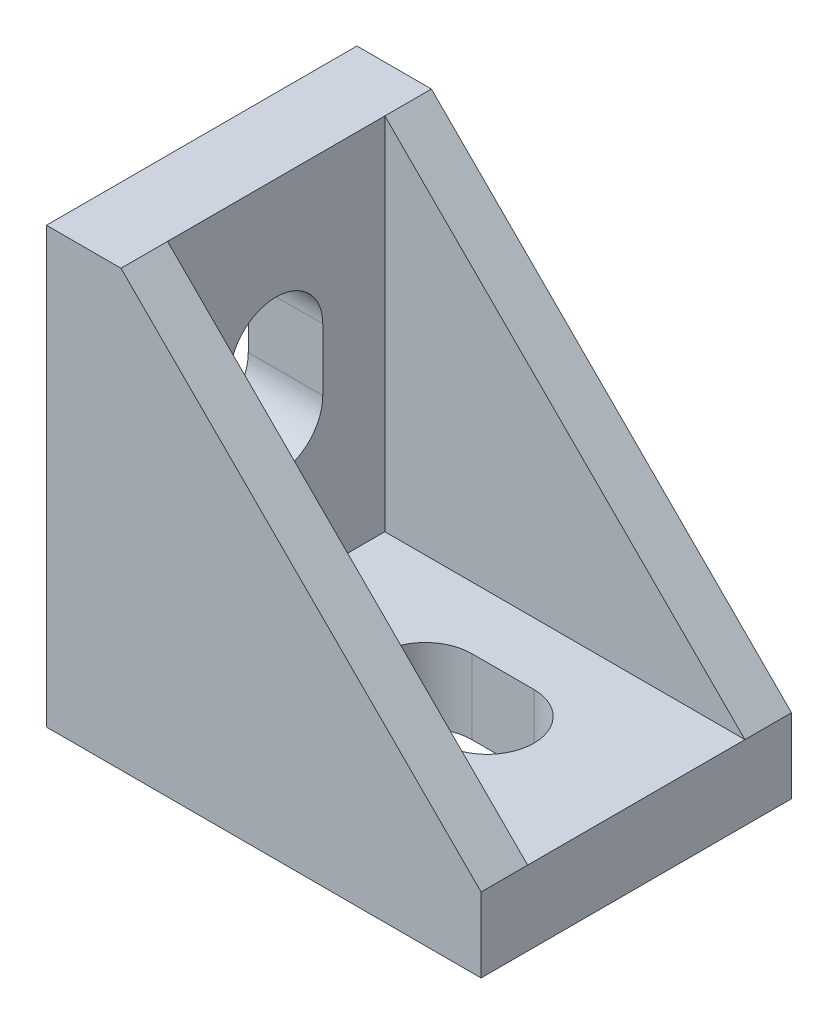
ISO-10303-21;
HEADER;
FILE_DESCRIPTION(('STEP AP214'),'2;1');
FILE_NAME('part.step','',(''),(''),'','','');
FILE_SCHEMA(('AUTOMOTIVE_DESIGN { 1 0 10303 214 1 1 1 1 }'));
ENDSEC;
DATA;
#1=APPLICATION_CONTEXT('core data for automotive mechanical design processes');
#2=APPLICATION_PROTOCOL_DEFINITION('international standard','automotive_design',2000,#1);
#3=PRODUCT_CONTEXT('',#1,'mechanical');
#4=PRODUCT('Part','Part','',(#3));
#5=PRODUCT_RELATED_PRODUCT_CATEGORY('part','',(#4));
#6=PRODUCT_DEFINITION_FORMATION('','',#4);
#7=PRODUCT_DEFINITION_CONTEXT('part definition',#1,'design');
#8=PRODUCT_DEFINITION('design','',#6,#7);
#9=PRODUCT_DEFINITION_SHAPE('','',#8);
#10=(LENGTH_UNIT() NAMED_UNIT(*) SI_UNIT(.MILLI.,.METRE.));
#11=(NAMED_UNIT(*) PLANE_ANGLE_UNIT() SI_UNIT($,.RADIAN.));
#12=(NAMED_UNIT(*) SI_UNIT($,.STERADIAN.) SOLID_ANGLE_UNIT());
#13=UNCERTAINTY_MEASURE_WITH_UNIT(LENGTH_MEASURE(1.E-05),#10,'distance_accuracy_value','');
#14=(GEOMETRIC_REPRESENTATION_CONTEXT(3) GLOBAL_UNCERTAINTY_ASSIGNED_CONTEXT((#13)) GLOBAL_UNIT_ASSIGNED_CONTEXT((#10,
#11,#12)) REPRESENTATION_CONTEXT('',''));
#15=CARTESIAN_POINT('',(0.,0.,0.));
#16=DIRECTION('',(0.,0.,1.));
#17=DIRECTION('',(1.,0.,0.));
#18=AXIS2_PLACEMENT_3D('',#15,#16,#17);
#19=CARTESIAN_POINT('',(0.,4.8,0.));
#20=DIRECTION('',(0.,-1.,0.));
#21=DIRECTION('',(0.,0.,-1.));
#22=AXIS2_PLACEMENT_3D('',#19,#20,#21);
#23=PLANE('',#22);
#24=DIRECTION('',(1.,0.,0.));
#25=VECTOR('',#24,1.);
#26=CARTESIAN_POINT('',(0.399999999999999,4.8,3.));
#27=LINE('',#26,#25);
#28=CARTESIAN_POINT('',(0.399999999999999,4.8,3.));
#29=VERTEX_POINT('',#28);
#30=CARTESIAN_POINT('',(4.4,4.8,3.));
#31=VERTEX_POINT('',#30);
#32=EDGE_CURVE('E220',#29,#31,#27,.T.);
#33=ORIENTED_EDGE('',*,*,#32,.F.);
#34=CARTESIAN_POINT('',(0.399999999999999,4.8,0.));
#35=DIRECTION('',(0.,1.,0.));
#36=DIRECTION('',(0.,0.,1.));
#37=AXIS2_PLACEMENT_3D('',#34,#35,#36);
#38=CIRCLE('',#37,3.);
#39=CARTESIAN_POINT('',(0.399999999999999,4.8,-3.));
#40=VERTEX_POINT('',#39);
#41=EDGE_CURVE('E55',#40,#29,#38,.T.);
#42=ORIENTED_EDGE('',*,*,#41,.F.);
#43=DIRECTION('',(-1.,0.,0.));
#44=VECTOR('',#43,1.);
#45=CARTESIAN_POINT('',(0.399999999999999,4.8,-3.));
#46=LINE('',#45,#44);
#47=CARTESIAN_POINT('',(4.4,4.8,-3.));
#48=VERTEX_POINT('',#47);
#49=EDGE_CURVE('E230',#48,#40,#46,.T.);
#50=ORIENTED_EDGE('',*,*,#49,.F.);
#51=CARTESIAN_POINT('',(4.4,4.8,0.));
#52=DIRECTION('',(0.,1.,0.));
#53=DIRECTION('',(0.,0.,1.));
#54=AXIS2_PLACEMENT_3D('',#51,#52,#53);
#55=CIRCLE('',#54,3.);
#56=EDGE_CURVE('E242',#31,#48,#55,.T.);
#57=ORIENTED_EDGE('',*,*,#56,.F.);
#58=EDGE_LOOP('',(#33,#42,#50,#57));
#59=FACE_BOUND('',#58,.T.);
#60=DIRECTION('',(0.,0.,-1.));
#61=VECTOR('',#60,1.);
#62=CARTESIAN_POINT('',(14.,4.8,10.));
#63=LINE('',#62,#61);
#64=CARTESIAN_POINT('',(14.,4.8,7.));
#65=VERTEX_POINT('',#64);
#66=CARTESIAN_POINT('',(14.,4.8,-7.));
#67=VERTEX_POINT('',#66);
#68=EDGE_CURVE('E169',#65,#67,#63,.T.);
#69=ORIENTED_EDGE('',*,*,#68,.T.);
#70=DIRECTION('',(-1.,0.,0.));
#71=VECTOR('',#70,1.);
#72=CARTESIAN_POINT('',(-9.2,4.8,-7.));
#73=LINE('',#72,#71);
#74=CARTESIAN_POINT('',(-9.2,4.8,-7.));
#75=VERTEX_POINT('',#74);
#76=EDGE_CURVE('E145',#67,#75,#73,.T.);
#77=ORIENTED_EDGE('',*,*,#76,.T.);
#78=DIRECTION('',(0.,0.,1.));
#79=VECTOR('',#78,1.);
#80=CARTESIAN_POINT('',(-9.2,4.8,0.));
#81=LINE('',#80,#79);
#82=CARTESIAN_POINT('',(-9.2,4.8,7.));
#83=VERTEX_POINT('',#82);
#84=EDGE_CURVE('E182',#75,#83,#81,.T.);
#85=ORIENTED_EDGE('',*,*,#84,.T.);
#86=DIRECTION('',(1.,0.,0.));
#87=VECTOR('',#86,1.);
#88=CARTESIAN_POINT('',(14.,4.8,7.));
#89=LINE('',#88,#87);
#90=EDGE_CURVE('E173',#83,#65,#89,.T.);
#91=ORIENTED_EDGE('',*,*,#90,.T.);
#92=EDGE_LOOP('',(#69,#77,#85,#91));
#93=FACE_BOUND('',#92,.T.);
#94=ADVANCED_FACE('F32',(#59,#93),#23,.F.);
#95=CARTESIAN_POINT('',(-9.2,0.,0.));
#96=DIRECTION('',(1.,0.,0.));
#97=DIRECTION('',(0.,0.,-1.));
#98=AXIS2_PLACEMENT_3D('',#95,#96,#97);
#99=PLANE('',#98);
#100=DIRECTION('',(0.,1.,0.));
#101=VECTOR('',#100,1.);
#102=CARTESIAN_POINT('',(-9.2,28.,-7.));
#103=LINE('',#102,#101);
#104=CARTESIAN_POINT('',(-9.2,28.,-7.));
#105=VERTEX_POINT('',#104);
#106=EDGE_CURVE('E150',#75,#105,#103,.T.);
#107=ORIENTED_EDGE('',*,*,#106,.T.);
#108=DIRECTION('',(0.,0.,-1.));
#109=VECTOR('',#108,1.);
#110=CARTESIAN_POINT('',(-9.2,28.,-10.));
#111=LINE('',#110,#109);
#112=CARTESIAN_POINT('',(-9.2,28.,7.));
#113=VERTEX_POINT('',#112);
#114=EDGE_CURVE('E290',#113,#105,#111,.T.);
#115=ORIENTED_EDGE('',*,*,#114,.F.);
#116=DIRECTION('',(0.,-1.,0.));
#117=VECTOR('',#116,1.);
#118=CARTESIAN_POINT('',(-9.2,4.8,7.));
#119=LINE('',#118,#117);
#120=EDGE_CURVE('E217',#113,#83,#119,.T.);
#121=ORIENTED_EDGE('',*,*,#120,.T.);
#122=ORIENTED_EDGE('',*,*,#84,.F.);
#123=EDGE_LOOP('',(#107,#115,#121,#122));
#124=FACE_BOUND('',#123,.T.);
#125=CARTESIAN_POINT('',(-9.2,18.4,0.));
#126=DIRECTION('',(1.,0.,0.));
#127=DIRECTION('',(0.,0.,-1.));
#128=AXIS2_PLACEMENT_3D('',#125,#126,#127);
#129=CIRCLE('',#128,3.);
#130=CARTESIAN_POINT('',(-9.2,18.4,-3.));
#131=VERTEX_POINT('',#130);
#132=CARTESIAN_POINT('',(-9.2,18.4,3.));
#133=VERTEX_POINT('',#132);
#134=EDGE_CURVE('E249',#131,#133,#129,.T.);
#135=ORIENTED_EDGE('',*,*,#134,.F.);
#136=DIRECTION('',(0.,1.,0.));
#137=VECTOR('',#136,1.);
#138=CARTESIAN_POINT('',(-9.2,18.4,-3.));
#139=LINE('',#138,#137);
#140=CARTESIAN_POINT('',(-9.2,14.4,-3.));
#141=VERTEX_POINT('',#140);
#142=EDGE_CURVE('E259',#141,#131,#139,.T.);
#143=ORIENTED_EDGE('',*,*,#142,.F.);
#144=CARTESIAN_POINT('',(-9.2,14.4,0.));
#145=DIRECTION('',(1.,0.,0.));
#146=DIRECTION('',(0.,0.,-1.));
#147=AXIS2_PLACEMENT_3D('',#144,#145,#146);
#148=CIRCLE('',#147,3.);
#149=CARTESIAN_POINT('',(-9.2,14.4,3.));
#150=VERTEX_POINT('',#149);
#151=EDGE_CURVE('E273',#150,#141,#148,.T.);
#152=ORIENTED_EDGE('',*,*,#151,.F.);
#153=DIRECTION('',(0.,-1.,0.));
#154=VECTOR('',#153,1.);
#155=CARTESIAN_POINT('',(-9.2,18.4,3.));
#156=LINE('',#155,#154);
#157=EDGE_CURVE('E270',#133,#150,#156,.T.);
#158=ORIENTED_EDGE('',*,*,#157,.F.);
#159=EDGE_LOOP('',(#135,#143,#152,#158));
#160=FACE_BOUND('',#159,.T.);
#161=ADVANCED_FACE('F302',(#124,#160),#99,.T.);
#162=CARTESIAN_POINT('',(14.,4.8,10.));
#163=DIRECTION('',(-1.,0.,0.));
#164=DIRECTION('',(0.,0.,1.));
#165=AXIS2_PLACEMENT_3D('',#162,#163,#164);
#166=PLANE('',#165);
#167=DIRECTION('',(0.,0.,-1.));
#168=VECTOR('',#167,1.);
#169=CARTESIAN_POINT('',(14.,0.,10.));
#170=LINE('',#169,#168);
#171=CARTESIAN_POINT('',(14.,0.,10.));
#172=VERTEX_POINT('',#171);
#173=CARTESIAN_POINT('',(14.,0.,-10.));
#174=VERTEX_POINT('',#173);
#175=EDGE_CURVE('E184',#172,#174,#170,.T.);
#176=ORIENTED_EDGE('',*,*,#175,.T.);
#177=DIRECTION('',(0.,-1.,0.));
#178=VECTOR('',#177,1.);
#179=CARTESIAN_POINT('',(14.,4.8,-10.));
#180=LINE('',#179,#178);
#181=CARTESIAN_POINT('',(14.,4.8,-10.));
#182=VERTEX_POINT('',#181);
#183=EDGE_CURVE('E11',#182,#174,#180,.T.);
#184=ORIENTED_EDGE('',*,*,#183,.F.);
#185=DIRECTION('',(0.,0.,-1.));
#186=VECTOR('',#185,1.);
#187=CARTESIAN_POINT('',(14.,4.8,-7.));
#188=LINE('',#187,#186);
#189=EDGE_CURVE('E158',#67,#182,#188,.T.);
#190=ORIENTED_EDGE('',*,*,#189,.F.);
#191=ORIENTED_EDGE('',*,*,#68,.F.);
#192=CARTESIAN_POINT('',(14.,4.8,10.));
#193=VERTEX_POINT('',#192);
#194=EDGE_CURVE('E174',#193,#65,#63,.T.);
#195=ORIENTED_EDGE('',*,*,#194,.F.);
#196=DIRECTION('',(0.,-1.,0.));
#197=VECTOR('',#196,1.);
#198=CARTESIAN_POINT('',(14.,4.8,10.));
#199=LINE('',#198,#197);
#200=EDGE_CURVE('E177',#193,#172,#199,.T.);
#201=ORIENTED_EDGE('',*,*,#200,.T.);
#202=EDGE_LOOP('',(#176,#184,#190,#191,#195,#201));
#203=FACE_BOUND('',#202,.T.);
#204=ADVANCED_FACE('F34',(#203),#166,.F.);
#205=CARTESIAN_POINT('',(-14.,4.8,-10.));
#206=DIRECTION('',(0.,0.,1.));
#207=DIRECTION('',(1.,0.,0.));
#208=AXIS2_PLACEMENT_3D('',#205,#206,#207);
#209=PLANE('',#208);
#210=DIRECTION('',(-1.,0.,0.));
#211=VECTOR('',#210,1.);
#212=CARTESIAN_POINT('',(-14.,0.,-10.));
#213=LINE('',#212,#211);
#214=CARTESIAN_POINT('',(-14.,0.,-10.));
#215=VERTEX_POINT('',#214);
#216=EDGE_CURVE('E186',#174,#215,#213,.T.);
#217=ORIENTED_EDGE('',*,*,#216,.T.);
#218=DIRECTION('',(0.,-1.,0.));
#219=VECTOR('',#218,1.);
#220=CARTESIAN_POINT('',(-14.,4.8,-10.));
#221=LINE('',#220,#219);
#222=CARTESIAN_POINT('',(-14.,28.,-10.));
#223=VERTEX_POINT('',#222);
#224=EDGE_CURVE('E40',#223,#215,#221,.T.);
#225=ORIENTED_EDGE('',*,*,#224,.F.);
#226=DIRECTION('',(-1.,0.,0.));
#227=VECTOR('',#226,1.);
#228=CARTESIAN_POINT('',(-9.2,28.,-10.));
#229=LINE('',#228,#227);
#230=CARTESIAN_POINT('',(-9.2,28.,-10.));
#231=VERTEX_POINT('',#230);
#232=EDGE_CURVE('E292',#231,#223,#229,.T.);
#233=ORIENTED_EDGE('',*,*,#232,.F.);
#234=DIRECTION('',(0.707106781186548,-0.707106781186548,0.));
#235=VECTOR('',#234,1.);
#236=CARTESIAN_POINT('',(14.,4.8,-10.));
#237=LINE('',#236,#235);
#238=EDGE_CURVE('E162',#231,#182,#237,.T.);
#239=ORIENTED_EDGE('',*,*,#238,.T.);
#240=ORIENTED_EDGE('',*,*,#183,.T.);
#241=EDGE_LOOP('',(#217,#225,#233,#239,#240));
#242=FACE_BOUND('',#241,.T.);
#243=ADVANCED_FACE('F297',(#242),#209,.F.);
#244=CARTESIAN_POINT('',(-14.,4.8,10.));
#245=DIRECTION('',(1.,0.,0.));
#246=DIRECTION('',(0.,0.,-1.));
#247=AXIS2_PLACEMENT_3D('',#244,#245,#246);
#248=PLANE('',#247);
#249=DIRECTION('',(0.,1.,0.));
#250=VECTOR('',#249,1.);
#251=CARTESIAN_POINT('',(-14.,18.4,-3.));
#252=LINE('',#251,#250);
#253=CARTESIAN_POINT('',(-14.,14.4,-3.));
#254=VERTEX_POINT('',#253);
#255=CARTESIAN_POINT('',(-14.,18.4,-3.));
#256=VERTEX_POINT('',#255);
#257=EDGE_CURVE('E265',#254,#256,#252,.T.);
#258=ORIENTED_EDGE('',*,*,#257,.T.);
#259=CARTESIAN_POINT('',(-14.,18.4,0.));
#260=DIRECTION('',(1.,0.,0.));
#261=DIRECTION('',(0.,0.,-1.));
#262=AXIS2_PLACEMENT_3D('',#259,#260,#261);
#263=CIRCLE('',#262,3.);
#264=CARTESIAN_POINT('',(-14.,18.4,3.));
#265=VERTEX_POINT('',#264);
#266=EDGE_CURVE('E255',#256,#265,#263,.T.);
#267=ORIENTED_EDGE('',*,*,#266,.T.);
#268=DIRECTION('',(0.,-1.,0.));
#269=VECTOR('',#268,1.);
#270=CARTESIAN_POINT('',(-14.,18.4,3.));
#271=LINE('',#270,#269);
#272=CARTESIAN_POINT('',(-14.,14.4,3.));
#273=VERTEX_POINT('',#272);
#274=EDGE_CURVE('E258',#265,#273,#271,.T.);
#275=ORIENTED_EDGE('',*,*,#274,.T.);
#276=CARTESIAN_POINT('',(-14.,14.4,0.));
#277=DIRECTION('',(1.,0.,0.));
#278=DIRECTION('',(0.,0.,-1.));
#279=AXIS2_PLACEMENT_3D('',#276,#277,#278);
#280=CIRCLE('',#279,3.);
#281=EDGE_CURVE('E262',#273,#254,#280,.T.);
#282=ORIENTED_EDGE('',*,*,#281,.T.);
#283=EDGE_LOOP('',(#258,#267,#275,#282));
#284=FACE_BOUND('',#283,.T.);
#285=DIRECTION('',(0.,0.,1.));
#286=VECTOR('',#285,1.);
#287=CARTESIAN_POINT('',(-14.,0.,10.));
#288=LINE('',#287,#286);
#289=CARTESIAN_POINT('',(-14.,0.,10.));
#290=VERTEX_POINT('',#289);
#291=EDGE_CURVE('E178',#215,#290,#288,.T.);
#292=ORIENTED_EDGE('',*,*,#291,.T.);
#293=DIRECTION('',(0.,-1.,0.));
#294=VECTOR('',#293,1.);
#295=CARTESIAN_POINT('',(-14.,4.8,10.));
#296=LINE('',#295,#294);
#297=CARTESIAN_POINT('',(-14.,28.,10.));
#298=VERTEX_POINT('',#297);
#299=EDGE_CURVE('E191',#298,#290,#296,.T.);
#300=ORIENTED_EDGE('',*,*,#299,.F.);
#301=DIRECTION('',(0.,0.,-1.));
#302=VECTOR('',#301,1.);
#303=CARTESIAN_POINT('',(-14.,28.,-10.));
#304=LINE('',#303,#302);
#305=EDGE_CURVE('E199',#298,#223,#304,.T.);
#306=ORIENTED_EDGE('',*,*,#305,.T.);
#307=ORIENTED_EDGE('',*,*,#224,.T.);
#308=EDGE_LOOP('',(#292,#300,#306,#307));
#309=FACE_BOUND('',#308,.T.);
#310=ADVANCED_FACE('F197',(#284,#309),#248,.F.);
#311=CARTESIAN_POINT('',(-14.,4.8,10.));
#312=DIRECTION('',(0.,0.,-1.));
#313=DIRECTION('',(-1.,0.,0.));
#314=AXIS2_PLACEMENT_3D('',#311,#312,#313);
#315=PLANE('',#314);
#316=ORIENTED_EDGE('',*,*,#200,.F.);
#317=DIRECTION('',(-0.707106781186548,0.707106781186548,0.));
#318=VECTOR('',#317,1.);
#319=CARTESIAN_POINT('',(-9.2,28.,10.));
#320=LINE('',#319,#318);
#321=CARTESIAN_POINT('',(-9.2,28.,10.));
#322=VERTEX_POINT('',#321);
#323=EDGE_CURVE('E213',#193,#322,#320,.T.);
#324=ORIENTED_EDGE('',*,*,#323,.T.);
#325=DIRECTION('',(-1.,0.,0.));
#326=VECTOR('',#325,1.);
#327=CARTESIAN_POINT('',(-9.2,28.,10.));
#328=LINE('',#327,#326);
#329=EDGE_CURVE('E289',#322,#298,#328,.T.);
#330=ORIENTED_EDGE('',*,*,#329,.T.);
#331=ORIENTED_EDGE('',*,*,#299,.T.);
#332=DIRECTION('',(1.,0.,0.));
#333=VECTOR('',#332,1.);
#334=CARTESIAN_POINT('',(-14.,0.,10.));
#335=LINE('',#334,#333);
#336=EDGE_CURVE('E175',#290,#172,#335,.T.);
#337=ORIENTED_EDGE('',*,*,#336,.T.);
#338=EDGE_LOOP('',(#316,#324,#330,#331,#337));
#339=FACE_BOUND('',#338,.T.);
#340=ADVANCED_FACE('F209',(#339),#315,.F.);
#341=CARTESIAN_POINT('',(0.,0.,0.));
#342=DIRECTION('',(0.,-1.,0.));
#343=DIRECTION('',(0.,0.,-1.));
#344=AXIS2_PLACEMENT_3D('',#341,#342,#343);
#345=PLANE('',#344);
#346=CARTESIAN_POINT('',(0.399999999999999,0.,0.));
#347=DIRECTION('',(0.,1.,0.));
#348=DIRECTION('',(0.,0.,1.));
#349=AXIS2_PLACEMENT_3D('',#346,#347,#348);
#350=CIRCLE('',#349,3.);
#351=CARTESIAN_POINT('',(0.399999999999999,0.,-3.));
#352=VERTEX_POINT('',#351);
#353=CARTESIAN_POINT('',(0.399999999999999,0.,3.));
#354=VERTEX_POINT('',#353);
#355=EDGE_CURVE('E226',#352,#354,#350,.T.);
#356=ORIENTED_EDGE('',*,*,#355,.T.);
#357=DIRECTION('',(1.,0.,0.));
#358=VECTOR('',#357,1.);
#359=CARTESIAN_POINT('',(0.399999999999999,0.,3.));
#360=LINE('',#359,#358);
#361=CARTESIAN_POINT('',(4.4,0.,3.));
#362=VERTEX_POINT('',#361);
#363=EDGE_CURVE('E229',#354,#362,#360,.T.);
#364=ORIENTED_EDGE('',*,*,#363,.T.);
#365=CARTESIAN_POINT('',(4.4,0.,0.));
#366=DIRECTION('',(0.,1.,0.));
#367=DIRECTION('',(0.,0.,1.));
#368=AXIS2_PLACEMENT_3D('',#365,#366,#367);
#369=CIRCLE('',#368,3.);
#370=CARTESIAN_POINT('',(4.4,0.,-3.));
#371=VERTEX_POINT('',#370);
#372=EDGE_CURVE('E233',#362,#371,#369,.T.);
#373=ORIENTED_EDGE('',*,*,#372,.T.);
#374=DIRECTION('',(-1.,0.,0.));
#375=VECTOR('',#374,1.);
#376=CARTESIAN_POINT('',(0.399999999999999,0.,-3.));
#377=LINE('',#376,#375);
#378=EDGE_CURVE('E236',#371,#352,#377,.T.);
#379=ORIENTED_EDGE('',*,*,#378,.T.);
#380=EDGE_LOOP('',(#356,#364,#373,#379));
#381=FACE_BOUND('',#380,.T.);
#382=ORIENTED_EDGE('',*,*,#175,.F.);
#383=ORIENTED_EDGE('',*,*,#336,.F.);
#384=ORIENTED_EDGE('',*,*,#291,.F.);
#385=ORIENTED_EDGE('',*,*,#216,.F.);
#386=EDGE_LOOP('',(#382,#383,#384,#385));
#387=FACE_BOUND('',#386,.T.);
#388=ADVANCED_FACE('F206',(#381,#387),#345,.T.);
#389=CARTESIAN_POINT('',(-9.2,28.,-10.));
#390=DIRECTION('',(0.,1.,0.));
#391=DIRECTION('',(0.,0.,1.));
#392=AXIS2_PLACEMENT_3D('',#389,#390,#391);
#393=PLANE('',#392);
#394=ORIENTED_EDGE('',*,*,#305,.F.);
#395=ORIENTED_EDGE('',*,*,#329,.F.);
#396=EDGE_CURVE('E286',#322,#113,#111,.T.);
#397=ORIENTED_EDGE('',*,*,#396,.T.);
#398=ORIENTED_EDGE('',*,*,#114,.T.);
#399=DIRECTION('',(0.,0.,-1.));
#400=VECTOR('',#399,1.);
#401=CARTESIAN_POINT('',(-9.2,28.,-7.));
#402=LINE('',#401,#400);
#403=EDGE_CURVE('E161',#105,#231,#402,.T.);
#404=ORIENTED_EDGE('',*,*,#403,.T.);
#405=ORIENTED_EDGE('',*,*,#232,.T.);
#406=EDGE_LOOP('',(#394,#395,#397,#398,#404,#405));
#407=FACE_BOUND('',#406,.T.);
#408=ADVANCED_FACE('F295',(#407),#393,.T.);
#409=CARTESIAN_POINT('',(-14.,18.4,0.));
#410=DIRECTION('',(1.,0.,0.));
#411=DIRECTION('',(0.,0.,-1.));
#412=AXIS2_PLACEMENT_3D('',#409,#410,#411);
#413=CYLINDRICAL_SURFACE('',#412,3.);
#414=ORIENTED_EDGE('',*,*,#134,.T.);
#415=DIRECTION('',(1.,0.,0.));
#416=VECTOR('',#415,1.);
#417=CARTESIAN_POINT('',(-14.,18.4,3.));
#418=LINE('',#417,#416);
#419=EDGE_CURVE('E268',#265,#133,#418,.T.);
#420=ORIENTED_EDGE('',*,*,#419,.F.);
#421=ORIENTED_EDGE('',*,*,#266,.F.);
#422=DIRECTION('',(1.,0.,0.));
#423=VECTOR('',#422,1.);
#424=CARTESIAN_POINT('',(-14.,18.4,-3.));
#425=LINE('',#424,#423);
#426=EDGE_CURVE('E278',#256,#131,#425,.T.);
#427=ORIENTED_EDGE('',*,*,#426,.T.);
#428=EDGE_LOOP('',(#414,#420,#421,#427));
#429=FACE_BOUND('',#428,.T.);
#430=ADVANCED_FACE('F311',(#429),#413,.F.);
#431=CARTESIAN_POINT('',(-14.,18.4,-3.));
#432=DIRECTION('',(0.,0.,-1.));
#433=DIRECTION('',(0.,1.,0.));
#434=AXIS2_PLACEMENT_3D('',#431,#432,#433);
#435=PLANE('',#434);
#436=ORIENTED_EDGE('',*,*,#142,.T.);
#437=ORIENTED_EDGE('',*,*,#426,.F.);
#438=ORIENTED_EDGE('',*,*,#257,.F.);
#439=DIRECTION('',(1.,0.,0.));
#440=VECTOR('',#439,1.);
#441=CARTESIAN_POINT('',(-14.,14.4,-3.));
#442=LINE('',#441,#440);
#443=EDGE_CURVE('E280',#254,#141,#442,.T.);
#444=ORIENTED_EDGE('',*,*,#443,.T.);
#445=EDGE_LOOP('',(#436,#437,#438,#444));
#446=FACE_BOUND('',#445,.T.);
#447=ADVANCED_FACE('F320',(#446),#435,.F.);
#448=CARTESIAN_POINT('',(-14.,14.4,0.));
#449=DIRECTION('',(1.,0.,0.));
#450=DIRECTION('',(0.,0.,-1.));
#451=AXIS2_PLACEMENT_3D('',#448,#449,#450);
#452=CYLINDRICAL_SURFACE('',#451,3.);
#453=ORIENTED_EDGE('',*,*,#151,.T.);
#454=ORIENTED_EDGE('',*,*,#443,.F.);
#455=ORIENTED_EDGE('',*,*,#281,.F.);
#456=DIRECTION('',(1.,0.,0.));
#457=VECTOR('',#456,1.);
#458=CARTESIAN_POINT('',(-14.,14.4,3.));
#459=LINE('',#458,#457);
#460=EDGE_CURVE('E282',#273,#150,#459,.T.);
#461=ORIENTED_EDGE('',*,*,#460,.T.);
#462=EDGE_LOOP('',(#453,#454,#455,#461));
#463=FACE_BOUND('',#462,.T.);
#464=ADVANCED_FACE('F322',(#463),#452,.F.);
#465=CARTESIAN_POINT('',(-14.,18.4,3.));
#466=DIRECTION('',(0.,0.,1.));
#467=DIRECTION('',(0.,-1.,0.));
#468=AXIS2_PLACEMENT_3D('',#465,#466,#467);
#469=PLANE('',#468);
#470=ORIENTED_EDGE('',*,*,#157,.T.);
#471=ORIENTED_EDGE('',*,*,#460,.F.);
#472=ORIENTED_EDGE('',*,*,#274,.F.);
#473=ORIENTED_EDGE('',*,*,#419,.T.);
#474=EDGE_LOOP('',(#470,#471,#472,#473));
#475=FACE_BOUND('',#474,.T.);
#476=ADVANCED_FACE('F315',(#475),#469,.F.);
#477=CARTESIAN_POINT('',(0.399999999999999,0.,0.));
#478=DIRECTION('',(0.,1.,0.));
#479=DIRECTION('',(0.,0.,1.));
#480=AXIS2_PLACEMENT_3D('',#477,#478,#479);
#481=CYLINDRICAL_SURFACE('',#480,3.);
#482=ORIENTED_EDGE('',*,*,#41,.T.);
#483=DIRECTION('',(0.,1.,0.));
#484=VECTOR('',#483,1.);
#485=CARTESIAN_POINT('',(0.399999999999999,0.,3.));
#486=LINE('',#485,#484);
#487=EDGE_CURVE('E238',#354,#29,#486,.T.);
#488=ORIENTED_EDGE('',*,*,#487,.F.);
#489=ORIENTED_EDGE('',*,*,#355,.F.);
#490=DIRECTION('',(0.,1.,0.));
#491=VECTOR('',#490,1.);
#492=CARTESIAN_POINT('',(0.399999999999999,0.,-3.));
#493=LINE('',#492,#491);
#494=EDGE_CURVE('E247',#352,#40,#493,.T.);
#495=ORIENTED_EDGE('',*,*,#494,.T.);
#496=EDGE_LOOP('',(#482,#488,#489,#495));
#497=FACE_BOUND('',#496,.T.);
#498=ADVANCED_FACE('F329',(#497),#481,.F.);
#499=CARTESIAN_POINT('',(0.399999999999999,0.,-3.));
#500=DIRECTION('',(0.,0.,-1.));
#501=DIRECTION('',(-1.,0.,0.));
#502=AXIS2_PLACEMENT_3D('',#499,#500,#501);
#503=PLANE('',#502);
#504=ORIENTED_EDGE('',*,*,#49,.T.);
#505=ORIENTED_EDGE('',*,*,#494,.F.);
#506=ORIENTED_EDGE('',*,*,#378,.F.);
#507=DIRECTION('',(0.,1.,0.));
#508=VECTOR('',#507,1.);
#509=CARTESIAN_POINT('',(4.4,0.,-3.));
#510=LINE('',#509,#508);
#511=EDGE_CURVE('E250',#371,#48,#510,.T.);
#512=ORIENTED_EDGE('',*,*,#511,.T.);
#513=EDGE_LOOP('',(#504,#505,#506,#512));
#514=FACE_BOUND('',#513,.T.);
#515=ADVANCED_FACE('F405',(#514),#503,.F.);
#516=CARTESIAN_POINT('',(4.4,0.,0.));
#517=DIRECTION('',(0.,1.,0.));
#518=DIRECTION('',(0.,0.,1.));
#519=AXIS2_PLACEMENT_3D('',#516,#517,#518);
#520=CYLINDRICAL_SURFACE('',#519,3.);
#521=ORIENTED_EDGE('',*,*,#56,.T.);
#522=ORIENTED_EDGE('',*,*,#511,.F.);
#523=ORIENTED_EDGE('',*,*,#372,.F.);
#524=DIRECTION('',(0.,1.,0.));
#525=VECTOR('',#524,1.);
#526=CARTESIAN_POINT('',(4.4,0.,3.));
#527=LINE('',#526,#525);
#528=EDGE_CURVE('E252',#362,#31,#527,.T.);
#529=ORIENTED_EDGE('',*,*,#528,.T.);
#530=EDGE_LOOP('',(#521,#522,#523,#529));
#531=FACE_BOUND('',#530,.T.);
#532=ADVANCED_FACE('F395',(#531),#520,.F.);
#533=CARTESIAN_POINT('',(0.399999999999999,0.,3.));
#534=DIRECTION('',(0.,0.,1.));
#535=DIRECTION('',(1.,0.,0.));
#536=AXIS2_PLACEMENT_3D('',#533,#534,#535);
#537=PLANE('',#536);
#538=ORIENTED_EDGE('',*,*,#32,.T.);
#539=ORIENTED_EDGE('',*,*,#528,.F.);
#540=ORIENTED_EDGE('',*,*,#363,.F.);
#541=ORIENTED_EDGE('',*,*,#487,.T.);
#542=EDGE_LOOP('',(#538,#539,#540,#541));
#543=FACE_BOUND('',#542,.T.);
#544=ADVANCED_FACE('F381',(#543),#537,.F.);
#545=CARTESIAN_POINT('',(-9.2,28.,7.));
#546=DIRECTION('',(0.707106781186547,0.707106781186547,0.));
#547=DIRECTION('',(-0.707106781186548,0.707106781186548,0.));
#548=AXIS2_PLACEMENT_3D('',#545,#546,#547);
#549=PLANE('',#548);
#550=ORIENTED_EDGE('',*,*,#323,.F.);
#551=ORIENTED_EDGE('',*,*,#194,.T.);
#552=DIRECTION('',(-0.707106781186548,0.707106781186548,0.));
#553=VECTOR('',#552,1.);
#554=CARTESIAN_POINT('',(-9.2,28.,7.));
#555=LINE('',#554,#553);
#556=EDGE_CURVE('E47',#65,#113,#555,.T.);
#557=ORIENTED_EDGE('',*,*,#556,.T.);
#558=ORIENTED_EDGE('',*,*,#396,.F.);
#559=EDGE_LOOP('',(#550,#551,#557,#558));
#560=FACE_BOUND('',#559,.T.);
#561=ADVANCED_FACE('F212',(#560),#549,.T.);
#562=CARTESIAN_POINT('',(0.,0.,7.));
#563=DIRECTION('',(0.,0.,1.));
#564=DIRECTION('',(1.,0.,0.));
#565=AXIS2_PLACEMENT_3D('',#562,#563,#564);
#566=PLANE('',#565);
#567=ORIENTED_EDGE('',*,*,#120,.F.);
#568=ORIENTED_EDGE('',*,*,#556,.F.);
#569=ORIENTED_EDGE('',*,*,#90,.F.);
#570=EDGE_LOOP('',(#567,#568,#569));
#571=FACE_BOUND('',#570,.T.);
#572=ADVANCED_FACE('F215',(#571),#566,.F.);
#573=CARTESIAN_POINT('',(14.,4.8,-7.));
#574=DIRECTION('',(0.707106781186547,0.707106781186547,0.));
#575=DIRECTION('',(-0.707106781186548,0.707106781186548,0.));
#576=AXIS2_PLACEMENT_3D('',#573,#574,#575);
#577=PLANE('',#576);
#578=ORIENTED_EDGE('',*,*,#238,.F.);
#579=ORIENTED_EDGE('',*,*,#403,.F.);
#580=DIRECTION('',(0.707106781186548,-0.707106781186548,0.));
#581=VECTOR('',#580,1.);
#582=CARTESIAN_POINT('',(14.,4.8,-7.));
#583=LINE('',#582,#581);
#584=EDGE_CURVE('E148',#105,#67,#583,.T.);
#585=ORIENTED_EDGE('',*,*,#584,.T.);
#586=ORIENTED_EDGE('',*,*,#189,.T.);
#587=EDGE_LOOP('',(#578,#579,#585,#586));
#588=FACE_BOUND('',#587,.T.);
#589=ADVANCED_FACE('F157',(#588),#577,.T.);
#590=CARTESIAN_POINT('',(0.,0.,-7.));
#591=DIRECTION('',(0.,0.,1.));
#592=DIRECTION('',(1.,0.,0.));
#593=AXIS2_PLACEMENT_3D('',#590,#591,#592);
#594=PLANE('',#593);
#595=ORIENTED_EDGE('',*,*,#584,.F.);
#596=ORIENTED_EDGE('',*,*,#106,.F.);
#597=ORIENTED_EDGE('',*,*,#76,.F.);
#598=EDGE_LOOP('',(#595,#596,#597));
#599=FACE_BOUND('',#598,.T.);
#600=ADVANCED_FACE('F147',(#599),#594,.T.);
#601=CLOSED_SHELL('',(#94,#161,#204,#243,#310,#340,#388,#408,#430,#447,#464,#476,#498,#515,#532,
#544,#561,#572,#589,#600));
#602=MANIFOLD_SOLID_BREP('B2',#601);
#603=ADVANCED_BREP_SHAPE_REPRESENTATION('',(#18,#602),#14);
#604=SHAPE_DEFINITION_REPRESENTATION(#9,#603);
ENDSEC;
END-ISO-10303-21;
